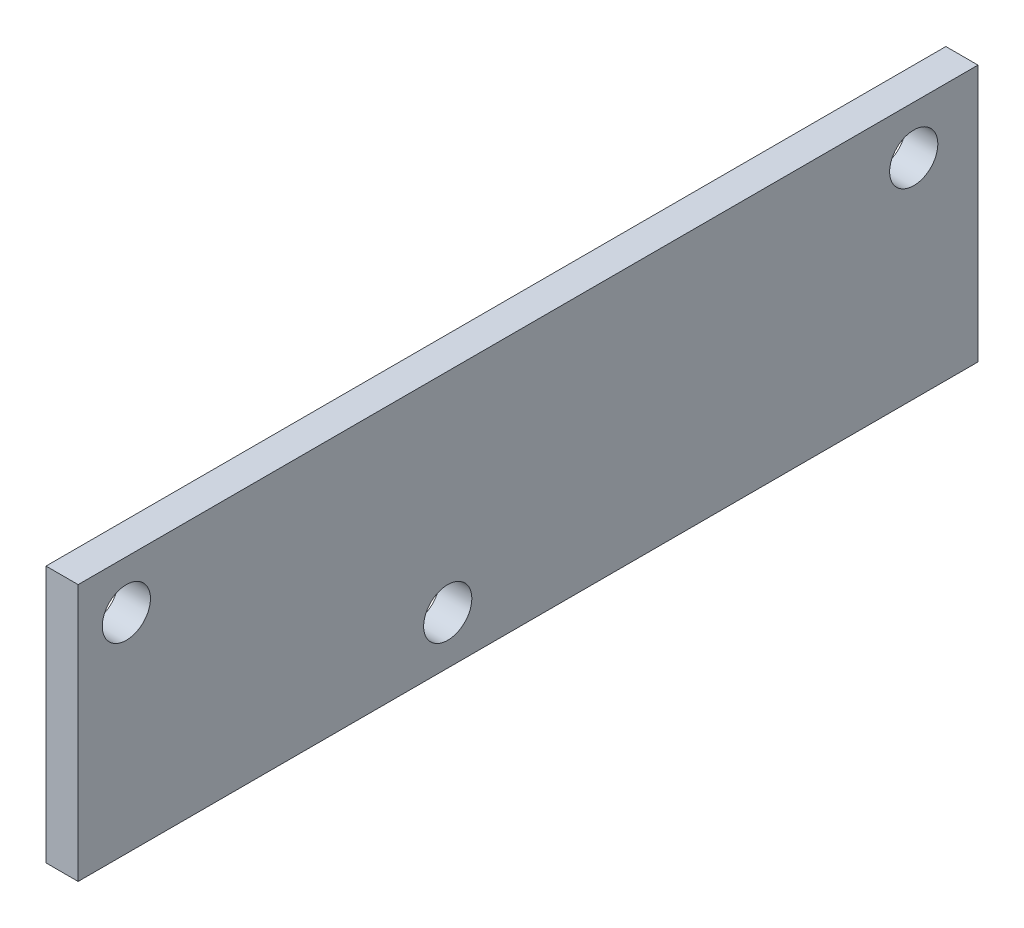
ISO-10303-21;
HEADER;
FILE_DESCRIPTION(('STEP AP214'),'2;1');
FILE_NAME('part.step','',(''),(''),'','','');
FILE_SCHEMA(('AUTOMOTIVE_DESIGN { 1 0 10303 214 1 1 1 1 }'));
ENDSEC;
DATA;
#1=APPLICATION_CONTEXT('core data for automotive mechanical design processes');
#2=APPLICATION_PROTOCOL_DEFINITION('international standard','automotive_design',2000,#1);
#3=PRODUCT_CONTEXT('',#1,'mechanical');
#4=PRODUCT('Part','Part','',(#3));
#5=PRODUCT_RELATED_PRODUCT_CATEGORY('part','',(#4));
#6=PRODUCT_DEFINITION_FORMATION('','',#4);
#7=PRODUCT_DEFINITION_CONTEXT('part definition',#1,'design');
#8=PRODUCT_DEFINITION('design','',#6,#7);
#9=PRODUCT_DEFINITION_SHAPE('','',#8);
#10=(LENGTH_UNIT() NAMED_UNIT(*) SI_UNIT(.MILLI.,.METRE.));
#11=(NAMED_UNIT(*) PLANE_ANGLE_UNIT() SI_UNIT($,.RADIAN.));
#12=(NAMED_UNIT(*) SI_UNIT($,.STERADIAN.) SOLID_ANGLE_UNIT());
#13=UNCERTAINTY_MEASURE_WITH_UNIT(LENGTH_MEASURE(1.E-05),#10,'distance_accuracy_value','');
#14=(GEOMETRIC_REPRESENTATION_CONTEXT(3) GLOBAL_UNCERTAINTY_ASSIGNED_CONTEXT((#13)) GLOBAL_UNIT_ASSIGNED_CONTEXT((#10,
#11,#12)) REPRESENTATION_CONTEXT('',''));
#15=CARTESIAN_POINT('',(0.,0.,0.));
#16=DIRECTION('',(0.,0.,1.));
#17=DIRECTION('',(1.,0.,0.));
#18=AXIS2_PLACEMENT_3D('',#15,#16,#17);
#19=CARTESIAN_POINT('',(6.35,50.8,-177.8));
#20=DIRECTION('',(0.,0.,1.));
#21=DIRECTION('',(0.,-1.,0.));
#22=AXIS2_PLACEMENT_3D('',#19,#20,#21);
#23=PLANE('',#22);
#24=DIRECTION('',(0.,1.,0.));
#25=VECTOR('',#24,1.);
#26=CARTESIAN_POINT('',(-6.35,50.8,-177.8));
#27=LINE('',#26,#25);
#28=CARTESIAN_POINT('',(-6.35,-50.8,-177.8));
#29=VERTEX_POINT('',#28);
#30=CARTESIAN_POINT('',(-6.35,50.8,-177.8));
#31=VERTEX_POINT('',#30);
#32=EDGE_CURVE('E96',#29,#31,#27,.T.);
#33=ORIENTED_EDGE('',*,*,#32,.T.);
#34=DIRECTION('',(-1.,0.,0.));
#35=VECTOR('',#34,1.);
#36=CARTESIAN_POINT('',(6.35,50.8,-177.8));
#37=LINE('',#36,#35);
#38=CARTESIAN_POINT('',(6.35,50.8,-177.8));
#39=VERTEX_POINT('',#38);
#40=EDGE_CURVE('E11',#39,#31,#37,.T.);
#41=ORIENTED_EDGE('',*,*,#40,.F.);
#42=DIRECTION('',(0.,1.,0.));
#43=VECTOR('',#42,1.);
#44=CARTESIAN_POINT('',(6.35,50.8,-177.8));
#45=LINE('',#44,#43);
#46=CARTESIAN_POINT('',(6.35,-50.8,-177.8));
#47=VERTEX_POINT('',#46);
#48=EDGE_CURVE('E84',#47,#39,#45,.T.);
#49=ORIENTED_EDGE('',*,*,#48,.F.);
#50=DIRECTION('',(-1.,0.,0.));
#51=VECTOR('',#50,1.);
#52=CARTESIAN_POINT('',(6.35,-50.8,-177.8));
#53=LINE('',#52,#51);
#54=EDGE_CURVE('E92',#47,#29,#53,.T.);
#55=ORIENTED_EDGE('',*,*,#54,.T.);
#56=EDGE_LOOP('',(#33,#41,#49,#55));
#57=FACE_BOUND('',#56,.T.);
#58=ADVANCED_FACE('F33',(#57),#23,.F.);
#59=CARTESIAN_POINT('',(6.35,50.8,177.8));
#60=DIRECTION('',(0.,-1.,0.));
#61=DIRECTION('',(0.,0.,-1.));
#62=AXIS2_PLACEMENT_3D('',#59,#60,#61);
#63=PLANE('',#62);
#64=DIRECTION('',(0.,0.,1.));
#65=VECTOR('',#64,1.);
#66=CARTESIAN_POINT('',(-6.35,50.8,177.8));
#67=LINE('',#66,#65);
#68=CARTESIAN_POINT('',(-6.35,50.8,177.8));
#69=VERTEX_POINT('',#68);
#70=EDGE_CURVE('E88',#31,#69,#67,.T.);
#71=ORIENTED_EDGE('',*,*,#70,.T.);
#72=DIRECTION('',(-1.,0.,0.));
#73=VECTOR('',#72,1.);
#74=CARTESIAN_POINT('',(6.35,50.8,177.8));
#75=LINE('',#74,#73);
#76=CARTESIAN_POINT('',(6.35,50.8,177.8));
#77=VERTEX_POINT('',#76);
#78=EDGE_CURVE('E41',#77,#69,#75,.T.);
#79=ORIENTED_EDGE('',*,*,#78,.F.);
#80=DIRECTION('',(0.,0.,1.));
#81=VECTOR('',#80,1.);
#82=CARTESIAN_POINT('',(6.35,50.8,177.8));
#83=LINE('',#82,#81);
#84=EDGE_CURVE('E79',#39,#77,#83,.T.);
#85=ORIENTED_EDGE('',*,*,#84,.F.);
#86=ORIENTED_EDGE('',*,*,#40,.T.);
#87=EDGE_LOOP('',(#71,#79,#85,#86));
#88=FACE_BOUND('',#87,.T.);
#89=ADVANCED_FACE('F87',(#88),#63,.F.);
#90=CARTESIAN_POINT('',(6.35,50.8,177.8));
#91=DIRECTION('',(0.,0.,-1.));
#92=DIRECTION('',(-1.,0.,0.));
#93=AXIS2_PLACEMENT_3D('',#90,#91,#92);
#94=PLANE('',#93);
#95=DIRECTION('',(0.,-1.,0.));
#96=VECTOR('',#95,1.);
#97=CARTESIAN_POINT('',(-6.35,50.8,177.8));
#98=LINE('',#97,#96);
#99=CARTESIAN_POINT('',(-6.35,-50.8,177.8));
#100=VERTEX_POINT('',#99);
#101=EDGE_CURVE('E66',#69,#100,#98,.T.);
#102=ORIENTED_EDGE('',*,*,#101,.T.);
#103=DIRECTION('',(-1.,0.,0.));
#104=VECTOR('',#103,1.);
#105=CARTESIAN_POINT('',(6.35,-50.8,177.8));
#106=LINE('',#105,#104);
#107=CARTESIAN_POINT('',(6.35,-50.8,177.8));
#108=VERTEX_POINT('',#107);
#109=EDGE_CURVE('E89',#108,#100,#106,.T.);
#110=ORIENTED_EDGE('',*,*,#109,.F.);
#111=DIRECTION('',(0.,-1.,0.));
#112=VECTOR('',#111,1.);
#113=CARTESIAN_POINT('',(6.35,50.8,177.8));
#114=LINE('',#113,#112);
#115=EDGE_CURVE('E82',#77,#108,#114,.T.);
#116=ORIENTED_EDGE('',*,*,#115,.F.);
#117=ORIENTED_EDGE('',*,*,#78,.T.);
#118=EDGE_LOOP('',(#102,#110,#116,#117));
#119=FACE_BOUND('',#118,.T.);
#120=ADVANCED_FACE('F90',(#119),#94,.F.);
#121=CARTESIAN_POINT('',(6.35,-50.8,177.8));
#122=DIRECTION('',(0.,1.,0.));
#123=DIRECTION('',(0.,0.,1.));
#124=AXIS2_PLACEMENT_3D('',#121,#122,#123);
#125=PLANE('',#124);
#126=DIRECTION('',(0.,0.,-1.));
#127=VECTOR('',#126,1.);
#128=CARTESIAN_POINT('',(-6.35,-50.8,177.8));
#129=LINE('',#128,#127);
#130=EDGE_CURVE('E72',#100,#29,#129,.T.);
#131=ORIENTED_EDGE('',*,*,#130,.T.);
#132=ORIENTED_EDGE('',*,*,#54,.F.);
#133=DIRECTION('',(0.,0.,-1.));
#134=VECTOR('',#133,1.);
#135=CARTESIAN_POINT('',(6.35,-50.8,177.8));
#136=LINE('',#135,#134);
#137=EDGE_CURVE('E49',#108,#47,#136,.T.);
#138=ORIENTED_EDGE('',*,*,#137,.F.);
#139=ORIENTED_EDGE('',*,*,#109,.T.);
#140=EDGE_LOOP('',(#131,#132,#138,#139));
#141=FACE_BOUND('',#140,.T.);
#142=ADVANCED_FACE('F104',(#141),#125,.F.);
#143=CARTESIAN_POINT('',(6.35,0.,0.));
#144=DIRECTION('',(1.,0.,0.));
#145=DIRECTION('',(0.,0.,-1.));
#146=AXIS2_PLACEMENT_3D('',#143,#144,#145);
#147=PLANE('',#146);
#148=CARTESIAN_POINT('',(6.35,31.75,-152.4));
#149=DIRECTION('',(1.,0.,0.));
#150=DIRECTION('',(0.,0.,-1.));
#151=AXIS2_PLACEMENT_3D('',#148,#149,#150);
#152=CIRCLE('',#151,9.525);
#153=CARTESIAN_POINT('',(6.35,31.75,-161.925));
#154=VERTEX_POINT('',#153);
#155=EDGE_CURVE('E124',#154,#154,#152,.T.);
#156=ORIENTED_EDGE('',*,*,#155,.F.);
#157=EDGE_LOOP('',(#156));
#158=FACE_BOUND('',#157,.T.);
#159=CARTESIAN_POINT('',(6.35,-31.75,31.75));
#160=DIRECTION('',(1.,0.,0.));
#161=DIRECTION('',(0.,0.,-1.));
#162=AXIS2_PLACEMENT_3D('',#159,#160,#161);
#163=CIRCLE('',#162,9.52500000000001);
#164=CARTESIAN_POINT('',(6.35,-31.75,22.225));
#165=VERTEX_POINT('',#164);
#166=EDGE_CURVE('E118',#165,#165,#163,.T.);
#167=ORIENTED_EDGE('',*,*,#166,.F.);
#168=EDGE_LOOP('',(#167));
#169=FACE_BOUND('',#168,.T.);
#170=CARTESIAN_POINT('',(6.35,31.75,158.75));
#171=DIRECTION('',(1.,0.,0.));
#172=DIRECTION('',(0.,0.,-1.));
#173=AXIS2_PLACEMENT_3D('',#170,#171,#172);
#174=CIRCLE('',#173,9.525);
#175=CARTESIAN_POINT('',(6.35,31.75,149.225));
#176=VERTEX_POINT('',#175);
#177=EDGE_CURVE('E112',#176,#176,#174,.T.);
#178=ORIENTED_EDGE('',*,*,#177,.F.);
#179=EDGE_LOOP('',(#178));
#180=FACE_BOUND('',#179,.T.);
#181=ORIENTED_EDGE('',*,*,#48,.T.);
#182=ORIENTED_EDGE('',*,*,#84,.T.);
#183=ORIENTED_EDGE('',*,*,#115,.T.);
#184=ORIENTED_EDGE('',*,*,#137,.T.);
#185=EDGE_LOOP('',(#181,#182,#183,#184));
#186=FACE_BOUND('',#185,.T.);
#187=ADVANCED_FACE('F80',(#158,#169,#180,#186),#147,.T.);
#188=CARTESIAN_POINT('',(-6.35,0.,0.));
#189=DIRECTION('',(1.,0.,0.));
#190=DIRECTION('',(0.,0.,-1.));
#191=AXIS2_PLACEMENT_3D('',#188,#189,#190);
#192=PLANE('',#191);
#193=CARTESIAN_POINT('',(-6.35,31.75,-152.4));
#194=DIRECTION('',(1.,0.,0.));
#195=DIRECTION('',(0.,0.,-1.));
#196=AXIS2_PLACEMENT_3D('',#193,#194,#195);
#197=CIRCLE('',#196,9.525);
#198=CARTESIAN_POINT('',(-6.35,31.75,-161.925));
#199=VERTEX_POINT('',#198);
#200=EDGE_CURVE('E121',#199,#199,#197,.F.);
#201=ORIENTED_EDGE('',*,*,#200,.F.);
#202=EDGE_LOOP('',(#201));
#203=FACE_BOUND('',#202,.T.);
#204=CARTESIAN_POINT('',(-6.35,-31.75,31.75));
#205=DIRECTION('',(1.,0.,0.));
#206=DIRECTION('',(0.,0.,-1.));
#207=AXIS2_PLACEMENT_3D('',#204,#205,#206);
#208=CIRCLE('',#207,9.52500000000001);
#209=CARTESIAN_POINT('',(-6.35,-31.75,22.225));
#210=VERTEX_POINT('',#209);
#211=EDGE_CURVE('E115',#210,#210,#208,.F.);
#212=ORIENTED_EDGE('',*,*,#211,.F.);
#213=EDGE_LOOP('',(#212));
#214=FACE_BOUND('',#213,.T.);
#215=CARTESIAN_POINT('',(-6.35,31.75,158.75));
#216=DIRECTION('',(1.,0.,0.));
#217=DIRECTION('',(0.,0.,-1.));
#218=AXIS2_PLACEMENT_3D('',#215,#216,#217);
#219=CIRCLE('',#218,9.525);
#220=CARTESIAN_POINT('',(-6.35,31.75,149.225));
#221=VERTEX_POINT('',#220);
#222=EDGE_CURVE('E99',#221,#221,#219,.F.);
#223=ORIENTED_EDGE('',*,*,#222,.F.);
#224=EDGE_LOOP('',(#223));
#225=FACE_BOUND('',#224,.T.);
#226=ORIENTED_EDGE('',*,*,#32,.F.);
#227=ORIENTED_EDGE('',*,*,#130,.F.);
#228=ORIENTED_EDGE('',*,*,#101,.F.);
#229=ORIENTED_EDGE('',*,*,#70,.F.);
#230=EDGE_LOOP('',(#226,#227,#228,#229));
#231=FACE_BOUND('',#230,.T.);
#232=ADVANCED_FACE('F107',(#203,#214,#225,#231),#192,.F.);
#233=CARTESIAN_POINT('',(-6.351,31.75,158.75));
#234=DIRECTION('',(1.,0.,0.));
#235=DIRECTION('',(0.,0.,-1.));
#236=AXIS2_PLACEMENT_3D('',#233,#234,#235);
#237=CYLINDRICAL_SURFACE('',#236,9.525);
#238=ORIENTED_EDGE('',*,*,#177,.T.);
#239=EDGE_LOOP('',(#238));
#240=FACE_BOUND('',#239,.T.);
#241=ORIENTED_EDGE('',*,*,#222,.T.);
#242=EDGE_LOOP('',(#241));
#243=FACE_BOUND('',#242,.T.);
#244=ADVANCED_FACE('F138',(#240,#243),#237,.F.);
#245=CARTESIAN_POINT('',(-6.351,-31.75,31.75));
#246=DIRECTION('',(1.,0.,0.));
#247=DIRECTION('',(0.,0.,-1.));
#248=AXIS2_PLACEMENT_3D('',#245,#246,#247);
#249=CYLINDRICAL_SURFACE('',#248,9.52500000000001);
#250=ORIENTED_EDGE('',*,*,#166,.T.);
#251=EDGE_LOOP('',(#250));
#252=FACE_BOUND('',#251,.T.);
#253=ORIENTED_EDGE('',*,*,#211,.T.);
#254=EDGE_LOOP('',(#253));
#255=FACE_BOUND('',#254,.T.);
#256=ADVANCED_FACE('F141',(#252,#255),#249,.F.);
#257=CARTESIAN_POINT('',(-6.351,31.75,-152.4));
#258=DIRECTION('',(1.,0.,0.));
#259=DIRECTION('',(0.,0.,-1.));
#260=AXIS2_PLACEMENT_3D('',#257,#258,#259);
#261=CYLINDRICAL_SURFACE('',#260,9.525);
#262=ORIENTED_EDGE('',*,*,#155,.T.);
#263=EDGE_LOOP('',(#262));
#264=FACE_BOUND('',#263,.T.);
#265=ORIENTED_EDGE('',*,*,#200,.T.);
#266=EDGE_LOOP('',(#265));
#267=FACE_BOUND('',#266,.T.);
#268=ADVANCED_FACE('F128',(#264,#267),#261,.F.);
#269=CLOSED_SHELL('',(#58,#89,#120,#142,#187,#232,#244,#256,#268));
#270=MANIFOLD_SOLID_BREP('B2',#269);
#271=ADVANCED_BREP_SHAPE_REPRESENTATION('',(#18,#270),#14);
#272=SHAPE_DEFINITION_REPRESENTATION(#9,#271);
ENDSEC;
END-ISO-10303-21;
